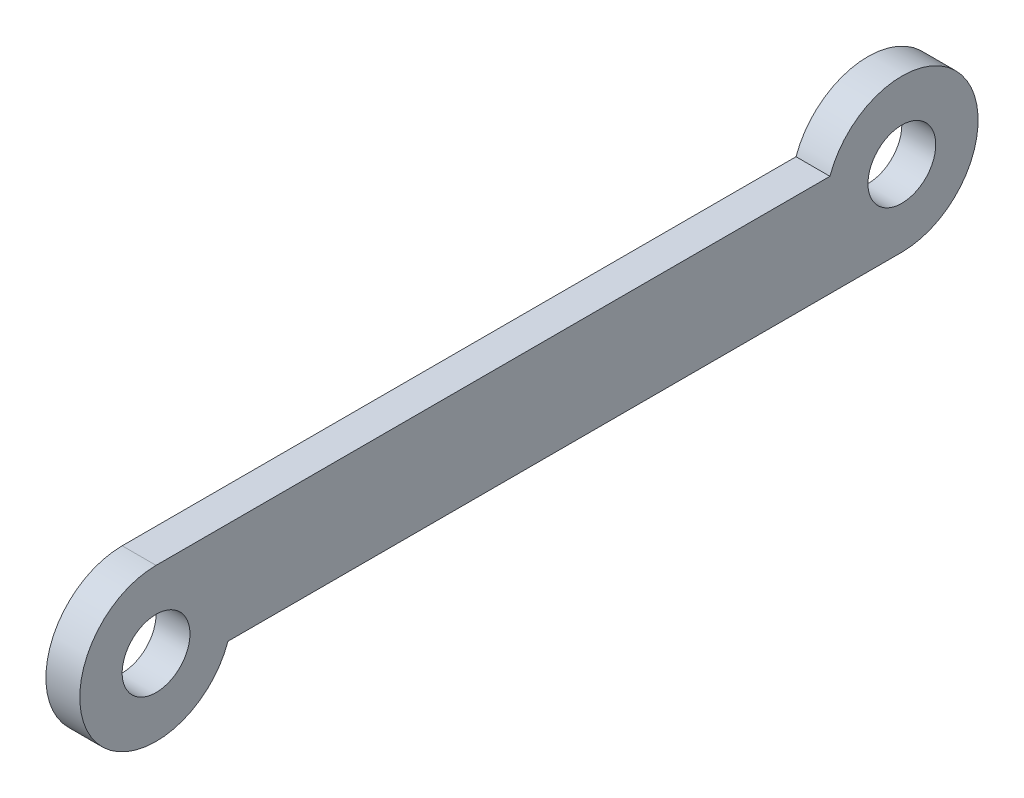
ISO-10303-21;
HEADER;
FILE_DESCRIPTION(('STEP AP214'),'2;1');
FILE_NAME('part.step','',(''),(''),'','','');
FILE_SCHEMA(('AUTOMOTIVE_DESIGN { 1 0 10303 214 1 1 1 1 }'));
ENDSEC;
DATA;
#1=APPLICATION_CONTEXT('core data for automotive mechanical design processes');
#2=APPLICATION_PROTOCOL_DEFINITION('international standard','automotive_design',2000,#1);
#3=PRODUCT_CONTEXT('',#1,'mechanical');
#4=PRODUCT('Part','Part','',(#3));
#5=PRODUCT_RELATED_PRODUCT_CATEGORY('part','',(#4));
#6=PRODUCT_DEFINITION_FORMATION('','',#4);
#7=PRODUCT_DEFINITION_CONTEXT('part definition',#1,'design');
#8=PRODUCT_DEFINITION('design','',#6,#7);
#9=PRODUCT_DEFINITION_SHAPE('','',#8);
#10=(LENGTH_UNIT() NAMED_UNIT(*) SI_UNIT(.MILLI.,.METRE.));
#11=(NAMED_UNIT(*) PLANE_ANGLE_UNIT() SI_UNIT($,.RADIAN.));
#12=(NAMED_UNIT(*) SI_UNIT($,.STERADIAN.) SOLID_ANGLE_UNIT());
#13=UNCERTAINTY_MEASURE_WITH_UNIT(LENGTH_MEASURE(1.E-05),#10,'distance_accuracy_value','');
#14=(GEOMETRIC_REPRESENTATION_CONTEXT(3) GLOBAL_UNCERTAINTY_ASSIGNED_CONTEXT((#13)) GLOBAL_UNIT_ASSIGNED_CONTEXT((#10,
#11,#12)) REPRESENTATION_CONTEXT('',''));
#15=CARTESIAN_POINT('',(0.,0.,0.));
#16=DIRECTION('',(0.,0.,1.));
#17=DIRECTION('',(1.,0.,0.));
#18=AXIS2_PLACEMENT_3D('',#15,#16,#17);
#19=CARTESIAN_POINT('',(0.,0.,0.));
#20=DIRECTION('',(1.,0.,0.));
#21=DIRECTION('',(0.,0.,-1.));
#22=AXIS2_PLACEMENT_3D('',#19,#20,#21);
#23=PLANE('',#22);
#24=CARTESIAN_POINT('',(0.,1.5,-22.));
#25=DIRECTION('',(1.,0.,0.));
#26=DIRECTION('',(0.,0.,-1.));
#27=AXIS2_PLACEMENT_3D('',#24,#25,#26);
#28=CIRCLE('',#27,2.25);
#29=CARTESIAN_POINT('',(0.,2.25,-19.8786796564404));
#30=VERTEX_POINT('',#29);
#31=CARTESIAN_POINT('',(0.,-0.750000000000003,-22.));
#32=VERTEX_POINT('',#31);
#33=EDGE_CURVE('E58',#30,#32,#28,.F.);
#34=ORIENTED_EDGE('',*,*,#33,.F.);
#35=DIRECTION('',(0.,0.,1.));
#36=VECTOR('',#35,1.);
#37=CARTESIAN_POINT('',(0.,2.25,0.));
#38=LINE('',#37,#36);
#39=CARTESIAN_POINT('',(0.,2.25,0.));
#40=VERTEX_POINT('',#39);
#41=EDGE_CURVE('E53',#40,#30,#38,.F.);
#42=ORIENTED_EDGE('',*,*,#41,.F.);
#43=CARTESIAN_POINT('',(0.,0.,0.));
#44=DIRECTION('',(1.,0.,0.));
#45=DIRECTION('',(0.,0.,-1.));
#46=AXIS2_PLACEMENT_3D('',#43,#44,#45);
#47=CIRCLE('',#46,2.25);
#48=CARTESIAN_POINT('',(0.,-0.750000000000004,-2.12132034355964));
#49=VERTEX_POINT('',#48);
#50=EDGE_CURVE('E70',#49,#40,#47,.F.);
#51=ORIENTED_EDGE('',*,*,#50,.F.);
#52=DIRECTION('',(0.,0.,-1.));
#53=VECTOR('',#52,1.);
#54=CARTESIAN_POINT('',(0.,-0.750000000000001,-22.));
#55=LINE('',#54,#53);
#56=EDGE_CURVE('E68',#32,#49,#55,.F.);
#57=ORIENTED_EDGE('',*,*,#56,.F.);
#58=EDGE_LOOP('',(#34,#42,#51,#57));
#59=FACE_BOUND('',#58,.T.);
#60=CARTESIAN_POINT('',(0.,0.,0.));
#61=DIRECTION('',(1.,0.,0.));
#62=DIRECTION('',(0.,0.,-1.));
#63=AXIS2_PLACEMENT_3D('',#60,#61,#62);
#64=CIRCLE('',#63,1.);
#65=CARTESIAN_POINT('',(0.,0.,-1.));
#66=VERTEX_POINT('',#65);
#67=EDGE_CURVE('E74',#66,#66,#64,.F.);
#68=ORIENTED_EDGE('',*,*,#67,.T.);
#69=EDGE_LOOP('',(#68));
#70=FACE_BOUND('',#69,.T.);
#71=CARTESIAN_POINT('',(0.,1.5,-22.));
#72=DIRECTION('',(1.,0.,0.));
#73=DIRECTION('',(0.,0.,-1.));
#74=AXIS2_PLACEMENT_3D('',#71,#72,#73);
#75=CIRCLE('',#74,0.999999999999997);
#76=CARTESIAN_POINT('',(0.,1.5,-23.));
#77=VERTEX_POINT('',#76);
#78=EDGE_CURVE('E19',#77,#77,#75,.F.);
#79=ORIENTED_EDGE('',*,*,#78,.T.);
#80=EDGE_LOOP('',(#79));
#81=FACE_BOUND('',#80,.T.);
#82=ADVANCED_FACE('F16',(#59,#70,#81),#23,.T.);
#83=CARTESIAN_POINT('',(-1.,1.5,-22.));
#84=DIRECTION('',(1.,0.,0.));
#85=DIRECTION('',(0.,0.,-1.));
#86=AXIS2_PLACEMENT_3D('',#83,#84,#85);
#87=CYLINDRICAL_SURFACE('',#86,0.999999999999997);
#88=CARTESIAN_POINT('',(-1.,1.5,-22.));
#89=DIRECTION('',(1.,0.,0.));
#90=DIRECTION('',(0.,0.,-1.));
#91=AXIS2_PLACEMENT_3D('',#88,#89,#90);
#92=CIRCLE('',#91,0.999999999999997);
#93=CARTESIAN_POINT('',(-1.,1.5,-23.));
#94=VERTEX_POINT('',#93);
#95=EDGE_CURVE('E89',#94,#94,#92,.F.);
#96=ORIENTED_EDGE('',*,*,#95,.T.);
#97=EDGE_LOOP('',(#96));
#98=FACE_BOUND('',#97,.T.);
#99=ORIENTED_EDGE('',*,*,#78,.F.);
#100=EDGE_LOOP('',(#99));
#101=FACE_BOUND('',#100,.T.);
#102=ADVANCED_FACE('F99',(#98,#101),#87,.F.);
#103=CARTESIAN_POINT('',(-1.,0.,0.));
#104=DIRECTION('',(1.,0.,0.));
#105=DIRECTION('',(0.,0.,-1.));
#106=AXIS2_PLACEMENT_3D('',#103,#104,#105);
#107=CYLINDRICAL_SURFACE('',#106,1.);
#108=CARTESIAN_POINT('',(-1.,0.,0.));
#109=DIRECTION('',(1.,0.,0.));
#110=DIRECTION('',(0.,0.,-1.));
#111=AXIS2_PLACEMENT_3D('',#108,#109,#110);
#112=CIRCLE('',#111,1.);
#113=CARTESIAN_POINT('',(-1.,0.,-1.));
#114=VERTEX_POINT('',#113);
#115=EDGE_CURVE('E86',#114,#114,#112,.F.);
#116=ORIENTED_EDGE('',*,*,#115,.T.);
#117=EDGE_LOOP('',(#116));
#118=FACE_BOUND('',#117,.T.);
#119=ORIENTED_EDGE('',*,*,#67,.F.);
#120=EDGE_LOOP('',(#119));
#121=FACE_BOUND('',#120,.T.);
#122=ADVANCED_FACE('F101',(#118,#121),#107,.F.);
#123=CARTESIAN_POINT('',(-1.,-0.750000000000001,-22.));
#124=DIRECTION('',(0.,-1.,0.));
#125=DIRECTION('',(0.,0.,-1.));
#126=AXIS2_PLACEMENT_3D('',#123,#124,#125);
#127=PLANE('',#126);
#128=DIRECTION('',(0.,0.,-1.));
#129=VECTOR('',#128,1.);
#130=CARTESIAN_POINT('',(-1.,-0.750000000000004,0.));
#131=LINE('',#130,#129);
#132=CARTESIAN_POINT('',(-1.,-0.750000000000004,-2.12132034355964));
#133=VERTEX_POINT('',#132);
#134=CARTESIAN_POINT('',(-1.,-0.750000000000004,-22.));
#135=VERTEX_POINT('',#134);
#136=EDGE_CURVE('E78',#133,#135,#131,.T.);
#137=ORIENTED_EDGE('',*,*,#136,.T.);
#138=DIRECTION('',(1.,0.,0.));
#139=VECTOR('',#138,1.);
#140=CARTESIAN_POINT('',(-1.,-0.750000000000004,-22.));
#141=LINE('',#140,#139);
#142=EDGE_CURVE('E62',#32,#135,#141,.F.);
#143=ORIENTED_EDGE('',*,*,#142,.F.);
#144=ORIENTED_EDGE('',*,*,#56,.T.);
#145=DIRECTION('',(1.,0.,0.));
#146=VECTOR('',#145,1.);
#147=CARTESIAN_POINT('',(-1.,-0.750000000000004,-2.12132034355964));
#148=LINE('',#147,#146);
#149=EDGE_CURVE('E92',#133,#49,#148,.T.);
#150=ORIENTED_EDGE('',*,*,#149,.F.);
#151=EDGE_LOOP('',(#137,#143,#144,#150));
#152=FACE_BOUND('',#151,.T.);
#153=ADVANCED_FACE('F77',(#152),#127,.T.);
#154=CARTESIAN_POINT('',(-1.,1.5,-22.));
#155=DIRECTION('',(1.,0.,0.));
#156=DIRECTION('',(0.,0.,-1.));
#157=AXIS2_PLACEMENT_3D('',#154,#155,#156);
#158=CYLINDRICAL_SURFACE('',#157,2.25);
#159=DIRECTION('',(1.,0.,0.));
#160=VECTOR('',#159,1.);
#161=CARTESIAN_POINT('',(-1.,2.25,-19.8786796564404));
#162=LINE('',#161,#160);
#163=CARTESIAN_POINT('',(-1.,2.25,-19.8786796564404));
#164=VERTEX_POINT('',#163);
#165=EDGE_CURVE('E64',#30,#164,#162,.F.);
#166=ORIENTED_EDGE('',*,*,#165,.F.);
#167=ORIENTED_EDGE('',*,*,#33,.T.);
#168=ORIENTED_EDGE('',*,*,#142,.T.);
#169=CARTESIAN_POINT('',(-1.,1.5,-22.));
#170=DIRECTION('',(1.,0.,0.));
#171=DIRECTION('',(0.,0.,-1.));
#172=AXIS2_PLACEMENT_3D('',#169,#170,#171);
#173=CIRCLE('',#172,2.25);
#174=EDGE_CURVE('E84',#135,#164,#173,.T.);
#175=ORIENTED_EDGE('',*,*,#174,.T.);
#176=EDGE_LOOP('',(#166,#167,#168,#175));
#177=FACE_BOUND('',#176,.T.);
#178=ADVANCED_FACE('F60',(#177),#158,.T.);
#179=CARTESIAN_POINT('',(-1.,2.25,0.));
#180=DIRECTION('',(0.,1.,0.));
#181=DIRECTION('',(0.,0.,1.));
#182=AXIS2_PLACEMENT_3D('',#179,#180,#181);
#183=PLANE('',#182);
#184=DIRECTION('',(0.,0.,-1.));
#185=VECTOR('',#184,1.);
#186=CARTESIAN_POINT('',(-1.,2.25,0.));
#187=LINE('',#186,#185);
#188=CARTESIAN_POINT('',(-1.,2.25,0.));
#189=VERTEX_POINT('',#188);
#190=EDGE_CURVE('E25',#164,#189,#187,.F.);
#191=ORIENTED_EDGE('',*,*,#190,.T.);
#192=DIRECTION('',(1.,0.,0.));
#193=VECTOR('',#192,1.);
#194=CARTESIAN_POINT('',(-1.,2.25,0.));
#195=LINE('',#194,#193);
#196=EDGE_CURVE('E33',#40,#189,#195,.F.);
#197=ORIENTED_EDGE('',*,*,#196,.F.);
#198=ORIENTED_EDGE('',*,*,#41,.T.);
#199=ORIENTED_EDGE('',*,*,#165,.T.);
#200=EDGE_LOOP('',(#191,#197,#198,#199));
#201=FACE_BOUND('',#200,.T.);
#202=ADVANCED_FACE('F119',(#201),#183,.T.);
#203=CARTESIAN_POINT('',(-1.,0.,0.));
#204=DIRECTION('',(1.,0.,0.));
#205=DIRECTION('',(0.,0.,-1.));
#206=AXIS2_PLACEMENT_3D('',#203,#204,#205);
#207=CYLINDRICAL_SURFACE('',#206,2.25);
#208=CARTESIAN_POINT('',(-1.,0.,0.));
#209=DIRECTION('',(1.,0.,0.));
#210=DIRECTION('',(0.,0.,-1.));
#211=AXIS2_PLACEMENT_3D('',#208,#209,#210);
#212=CIRCLE('',#211,2.25);
#213=EDGE_CURVE('E11',#189,#133,#212,.T.);
#214=ORIENTED_EDGE('',*,*,#213,.T.);
#215=ORIENTED_EDGE('',*,*,#149,.T.);
#216=ORIENTED_EDGE('',*,*,#50,.T.);
#217=ORIENTED_EDGE('',*,*,#196,.T.);
#218=EDGE_LOOP('',(#214,#215,#216,#217));
#219=FACE_BOUND('',#218,.T.);
#220=ADVANCED_FACE('F113',(#219),#207,.T.);
#221=CARTESIAN_POINT('',(-1.,0.,0.));
#222=DIRECTION('',(1.,0.,0.));
#223=DIRECTION('',(0.,0.,-1.));
#224=AXIS2_PLACEMENT_3D('',#221,#222,#223);
#225=PLANE('',#224);
#226=ORIENTED_EDGE('',*,*,#190,.F.);
#227=ORIENTED_EDGE('',*,*,#174,.F.);
#228=ORIENTED_EDGE('',*,*,#136,.F.);
#229=ORIENTED_EDGE('',*,*,#213,.F.);
#230=EDGE_LOOP('',(#226,#227,#228,#229));
#231=FACE_BOUND('',#230,.T.);
#232=ORIENTED_EDGE('',*,*,#115,.F.);
#233=EDGE_LOOP('',(#232));
#234=FACE_BOUND('',#233,.T.);
#235=ORIENTED_EDGE('',*,*,#95,.F.);
#236=EDGE_LOOP('',(#235));
#237=FACE_BOUND('',#236,.T.);
#238=ADVANCED_FACE('F111',(#231,#234,#237),#225,.F.);
#239=CLOSED_SHELL('',(#82,#102,#122,#153,#178,#202,#220,#238));
#240=MANIFOLD_SOLID_BREP('B1',#239);
#241=ADVANCED_BREP_SHAPE_REPRESENTATION('',(#18,#240),#14);
#242=SHAPE_DEFINITION_REPRESENTATION(#9,#241);
ENDSEC;
END-ISO-10303-21;
